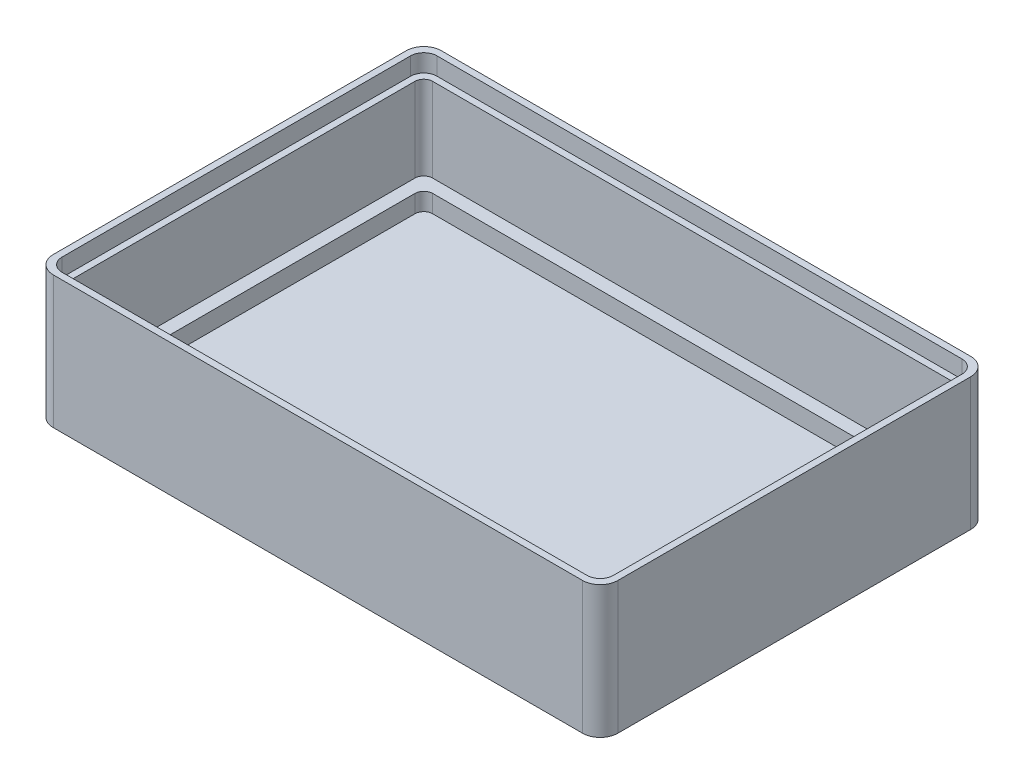
ISO-10303-21;
HEADER;
FILE_DESCRIPTION(('STEP AP214'),'2;1');
FILE_NAME('part.step','',(''),(''),'','','');
FILE_SCHEMA(('AUTOMOTIVE_DESIGN { 1 0 10303 214 1 1 1 1 }'));
ENDSEC;
DATA;
#1=APPLICATION_CONTEXT('core data for automotive mechanical design processes');
#2=APPLICATION_PROTOCOL_DEFINITION('international standard','automotive_design',2000,#1);
#3=PRODUCT_CONTEXT('',#1,'mechanical');
#4=PRODUCT('Part','Part','',(#3));
#5=PRODUCT_RELATED_PRODUCT_CATEGORY('part','',(#4));
#6=PRODUCT_DEFINITION_FORMATION('','',#4);
#7=PRODUCT_DEFINITION_CONTEXT('part definition',#1,'design');
#8=PRODUCT_DEFINITION('design','',#6,#7);
#9=PRODUCT_DEFINITION_SHAPE('','',#8);
#10=(LENGTH_UNIT() NAMED_UNIT(*) SI_UNIT(.MILLI.,.METRE.));
#11=(NAMED_UNIT(*) PLANE_ANGLE_UNIT() SI_UNIT($,.RADIAN.));
#12=(NAMED_UNIT(*) SI_UNIT($,.STERADIAN.) SOLID_ANGLE_UNIT());
#13=UNCERTAINTY_MEASURE_WITH_UNIT(LENGTH_MEASURE(1.E-05),#10,'distance_accuracy_value','');
#14=(GEOMETRIC_REPRESENTATION_CONTEXT(3) GLOBAL_UNCERTAINTY_ASSIGNED_CONTEXT((#13)) GLOBAL_UNIT_ASSIGNED_CONTEXT((#10,
#11,#12)) REPRESENTATION_CONTEXT('',''));
#15=CARTESIAN_POINT('',(0.,0.,0.));
#16=DIRECTION('',(0.,0.,1.));
#17=DIRECTION('',(1.,0.,0.));
#18=AXIS2_PLACEMENT_3D('',#15,#16,#17);
#19=CARTESIAN_POINT('',(62.5,1.5,-42.5));
#20=DIRECTION('',(1.,0.,0.));
#21=DIRECTION('',(0.,0.,-1.));
#22=AXIS2_PLACEMENT_3D('',#19,#20,#21);
#23=PLANE('',#22);
#24=DIRECTION('',(0.,1.,0.));
#25=VECTOR('',#24,1.);
#26=CARTESIAN_POINT('',(62.5,15.,-2.5));
#27=LINE('',#26,#25);
#28=CARTESIAN_POINT('',(62.5,3.5,-2.50000000000002));
#29=VERTEX_POINT('',#28);
#30=CARTESIAN_POINT('',(62.5,13.,-2.5));
#31=VERTEX_POINT('',#30);
#32=EDGE_CURVE('E265',#29,#31,#27,.T.);
#33=ORIENTED_EDGE('',*,*,#32,.T.);
#34=DIRECTION('',(0.,0.,-1.));
#35=VECTOR('',#34,1.);
#36=CARTESIAN_POINT('',(62.5,13.,-2.5));
#37=LINE('',#36,#35);
#38=CARTESIAN_POINT('',(62.5,13.,-41.5));
#39=VERTEX_POINT('',#38);
#40=EDGE_CURVE('E395',#31,#39,#37,.T.);
#41=ORIENTED_EDGE('',*,*,#40,.T.);
#42=DIRECTION('',(0.,1.,0.));
#43=VECTOR('',#42,1.);
#44=CARTESIAN_POINT('',(62.5,3.5,-41.5));
#45=LINE('',#44,#43);
#46=CARTESIAN_POINT('',(62.5,3.5,-41.5));
#47=VERTEX_POINT('',#46);
#48=EDGE_CURVE('E270',#39,#47,#45,.F.);
#49=ORIENTED_EDGE('',*,*,#48,.T.);
#50=DIRECTION('',(0.,0.,-1.));
#51=VECTOR('',#50,1.);
#52=CARTESIAN_POINT('',(62.5,3.5,-42.5));
#53=LINE('',#52,#51);
#54=EDGE_CURVE('E393',#29,#47,#53,.T.);
#55=ORIENTED_EDGE('',*,*,#54,.F.);
#56=EDGE_LOOP('',(#33,#41,#49,#55));
#57=FACE_BOUND('',#56,.T.);
#58=ADVANCED_FACE('F35',(#57),#23,.F.);
#59=CARTESIAN_POINT('',(62.5,1.5,-1.5));
#60=DIRECTION('',(0.,0.,1.));
#61=DIRECTION('',(1.,0.,0.));
#62=AXIS2_PLACEMENT_3D('',#59,#60,#61);
#63=PLANE('',#62);
#64=DIRECTION('',(0.,1.,0.));
#65=VECTOR('',#64,1.);
#66=CARTESIAN_POINT('',(2.5,15.,-1.49999999999999));
#67=LINE('',#66,#65);
#68=CARTESIAN_POINT('',(2.5,3.5,-1.49999999999999));
#69=VERTEX_POINT('',#68);
#70=CARTESIAN_POINT('',(2.5,13.,-1.49999999999999));
#71=VERTEX_POINT('',#70);
#72=EDGE_CURVE('E257',#69,#71,#67,.T.);
#73=ORIENTED_EDGE('',*,*,#72,.T.);
#74=DIRECTION('',(1.,0.,0.));
#75=VECTOR('',#74,1.);
#76=CARTESIAN_POINT('',(2.5,13.,-1.49999999999999));
#77=LINE('',#76,#75);
#78=CARTESIAN_POINT('',(61.5,13.,-1.5));
#79=VERTEX_POINT('',#78);
#80=EDGE_CURVE('E241',#71,#79,#77,.T.);
#81=ORIENTED_EDGE('',*,*,#80,.T.);
#82=DIRECTION('',(0.,1.,0.));
#83=VECTOR('',#82,1.);
#84=CARTESIAN_POINT('',(61.5,3.5,-1.5));
#85=LINE('',#84,#83);
#86=CARTESIAN_POINT('',(61.5,3.5,-1.49999999999999));
#87=VERTEX_POINT('',#86);
#88=EDGE_CURVE('E264',#79,#87,#85,.F.);
#89=ORIENTED_EDGE('',*,*,#88,.T.);
#90=DIRECTION('',(1.,0.,0.));
#91=VECTOR('',#90,1.);
#92=CARTESIAN_POINT('',(62.5,3.5,-1.49999999999999));
#93=LINE('',#92,#91);
#94=EDGE_CURVE('E263',#69,#87,#93,.T.);
#95=ORIENTED_EDGE('',*,*,#94,.F.);
#96=EDGE_LOOP('',(#73,#81,#89,#95));
#97=FACE_BOUND('',#96,.T.);
#98=ADVANCED_FACE('F261',(#97),#63,.F.);
#99=CARTESIAN_POINT('',(1.49999999999999,1.5,-42.5));
#100=DIRECTION('',(-1.,0.,0.));
#101=DIRECTION('',(0.,0.,1.));
#102=AXIS2_PLACEMENT_3D('',#99,#100,#101);
#103=PLANE('',#102);
#104=DIRECTION('',(0.,1.,0.));
#105=VECTOR('',#104,1.);
#106=CARTESIAN_POINT('',(1.49999999999999,15.,-41.5));
#107=LINE('',#106,#105);
#108=CARTESIAN_POINT('',(1.49999999999999,3.5,-41.5));
#109=VERTEX_POINT('',#108);
#110=CARTESIAN_POINT('',(1.49999999999999,13.,-41.5));
#111=VERTEX_POINT('',#110);
#112=EDGE_CURVE('E286',#109,#111,#107,.T.);
#113=ORIENTED_EDGE('',*,*,#112,.T.);
#114=DIRECTION('',(0.,0.,1.));
#115=VECTOR('',#114,1.);
#116=CARTESIAN_POINT('',(1.49999999999999,13.,-41.5));
#117=LINE('',#116,#115);
#118=CARTESIAN_POINT('',(1.49999999999999,13.,-2.50000000000001));
#119=VERTEX_POINT('',#118);
#120=EDGE_CURVE('E58',#111,#119,#117,.T.);
#121=ORIENTED_EDGE('',*,*,#120,.T.);
#122=DIRECTION('',(0.,1.,0.));
#123=VECTOR('',#122,1.);
#124=CARTESIAN_POINT('',(1.49999999999999,3.5,-2.49999999999999));
#125=LINE('',#124,#123);
#126=CARTESIAN_POINT('',(1.49999999999999,3.5,-2.50000000000001));
#127=VERTEX_POINT('',#126);
#128=EDGE_CURVE('E258',#119,#127,#125,.F.);
#129=ORIENTED_EDGE('',*,*,#128,.T.);
#130=DIRECTION('',(0.,0.,1.));
#131=VECTOR('',#130,1.);
#132=CARTESIAN_POINT('',(1.49999999999999,3.5,-42.5));
#133=LINE('',#132,#131);
#134=EDGE_CURVE('E351',#109,#127,#133,.T.);
#135=ORIENTED_EDGE('',*,*,#134,.F.);
#136=EDGE_LOOP('',(#113,#121,#129,#135));
#137=FACE_BOUND('',#136,.T.);
#138=ADVANCED_FACE('F459',(#137),#103,.F.);
#139=CARTESIAN_POINT('',(62.5,1.5,-42.5));
#140=DIRECTION('',(0.,0.,-1.));
#141=DIRECTION('',(-1.,0.,0.));
#142=AXIS2_PLACEMENT_3D('',#139,#140,#141);
#143=PLANE('',#142);
#144=DIRECTION('',(0.,1.,0.));
#145=VECTOR('',#144,1.);
#146=CARTESIAN_POINT('',(61.5,15.,-42.5));
#147=LINE('',#146,#145);
#148=CARTESIAN_POINT('',(61.5,3.5,-42.5));
#149=VERTEX_POINT('',#148);
#150=CARTESIAN_POINT('',(61.5,13.,-42.5));
#151=VERTEX_POINT('',#150);
#152=EDGE_CURVE('E283',#149,#151,#147,.T.);
#153=ORIENTED_EDGE('',*,*,#152,.T.);
#154=DIRECTION('',(-1.,0.,0.));
#155=VECTOR('',#154,1.);
#156=CARTESIAN_POINT('',(61.5,13.,-42.5));
#157=LINE('',#156,#155);
#158=CARTESIAN_POINT('',(2.5,13.,-42.5));
#159=VERTEX_POINT('',#158);
#160=EDGE_CURVE('E414',#151,#159,#157,.T.);
#161=ORIENTED_EDGE('',*,*,#160,.T.);
#162=DIRECTION('',(0.,1.,0.));
#163=VECTOR('',#162,1.);
#164=CARTESIAN_POINT('',(2.49999999999999,3.5,-42.5));
#165=LINE('',#164,#163);
#166=CARTESIAN_POINT('',(2.49999999999999,3.5,-42.5));
#167=VERTEX_POINT('',#166);
#168=EDGE_CURVE('E281',#159,#167,#165,.F.);
#169=ORIENTED_EDGE('',*,*,#168,.T.);
#170=DIRECTION('',(-1.,0.,0.));
#171=VECTOR('',#170,1.);
#172=CARTESIAN_POINT('',(62.5,3.5,-42.5));
#173=LINE('',#172,#171);
#174=EDGE_CURVE('E405',#149,#167,#173,.T.);
#175=ORIENTED_EDGE('',*,*,#174,.F.);
#176=EDGE_LOOP('',(#153,#161,#169,#175));
#177=FACE_BOUND('',#176,.T.);
#178=ADVANCED_FACE('F413',(#177),#143,.F.);
#179=CARTESIAN_POINT('',(0.,3.5,0.));
#180=DIRECTION('',(0.,-1.,0.));
#181=DIRECTION('',(0.,0.,-1.));
#182=AXIS2_PLACEMENT_3D('',#179,#180,#181);
#183=PLANE('',#182);
#184=ORIENTED_EDGE('',*,*,#94,.T.);
#185=CARTESIAN_POINT('',(61.5,3.5,-2.5));
#186=DIRECTION('',(0.,-1.,0.));
#187=DIRECTION('',(0.,0.,-1.));
#188=AXIS2_PLACEMENT_3D('',#185,#186,#187);
#189=CIRCLE('',#188,1.);
#190=EDGE_CURVE('E279',#87,#29,#189,.F.);
#191=ORIENTED_EDGE('',*,*,#190,.T.);
#192=ORIENTED_EDGE('',*,*,#54,.T.);
#193=CARTESIAN_POINT('',(61.5,3.5,-41.5));
#194=DIRECTION('',(0.,-1.,0.));
#195=DIRECTION('',(0.,0.,-1.));
#196=AXIS2_PLACEMENT_3D('',#193,#194,#195);
#197=CIRCLE('',#196,1.);
#198=EDGE_CURVE('E277',#47,#149,#197,.F.);
#199=ORIENTED_EDGE('',*,*,#198,.T.);
#200=ORIENTED_EDGE('',*,*,#174,.T.);
#201=CARTESIAN_POINT('',(2.49999999999999,3.5,-41.5));
#202=DIRECTION('',(0.,-1.,0.));
#203=DIRECTION('',(0.,0.,-1.));
#204=AXIS2_PLACEMENT_3D('',#201,#202,#203);
#205=CIRCLE('',#204,1.);
#206=EDGE_CURVE('E267',#167,#109,#205,.F.);
#207=ORIENTED_EDGE('',*,*,#206,.T.);
#208=ORIENTED_EDGE('',*,*,#134,.T.);
#209=CARTESIAN_POINT('',(2.5,3.5,-2.49999999999999));
#210=DIRECTION('',(0.,-1.,0.));
#211=DIRECTION('',(0.,0.,-1.));
#212=AXIS2_PLACEMENT_3D('',#209,#210,#211);
#213=CIRCLE('',#212,1.);
#214=EDGE_CURVE('E275',#127,#69,#213,.F.);
#215=ORIENTED_EDGE('',*,*,#214,.T.);
#216=EDGE_LOOP('',(#184,#191,#192,#199,#200,#207,#208,#215));
#217=FACE_BOUND('',#216,.T.);
#218=DIRECTION('',(0.,0.,-1.));
#219=VECTOR('',#218,1.);
#220=CARTESIAN_POINT('',(61.004099557469,3.5,-41.));
#221=LINE('',#220,#219);
#222=CARTESIAN_POINT('',(61.004099557469,3.5,-4.));
#223=VERTEX_POINT('',#222);
#224=CARTESIAN_POINT('',(61.004099557469,3.5,-40.));
#225=VERTEX_POINT('',#224);
#226=EDGE_CURVE('E584',#223,#225,#221,.T.);
#227=ORIENTED_EDGE('',*,*,#226,.F.);
#228=CARTESIAN_POINT('',(60.004099557469,3.5,-4.));
#229=DIRECTION('',(0.,-1.,0.));
#230=DIRECTION('',(0.,0.,-1.));
#231=AXIS2_PLACEMENT_3D('',#228,#229,#230);
#232=CIRCLE('',#231,1.);
#233=CARTESIAN_POINT('',(60.004099557469,3.5,-3.));
#234=VERTEX_POINT('',#233);
#235=EDGE_CURVE('E290',#223,#234,#232,.T.);
#236=ORIENTED_EDGE('',*,*,#235,.T.);
#237=DIRECTION('',(1.,0.,0.));
#238=VECTOR('',#237,1.);
#239=CARTESIAN_POINT('',(61.004099557469,3.5,-3.));
#240=LINE('',#239,#238);
#241=CARTESIAN_POINT('',(4.00409955746905,3.5,-3.));
#242=VERTEX_POINT('',#241);
#243=EDGE_CURVE('E406',#242,#234,#240,.T.);
#244=ORIENTED_EDGE('',*,*,#243,.F.);
#245=CARTESIAN_POINT('',(4.00409955746904,3.5,-4.));
#246=DIRECTION('',(0.,-1.,0.));
#247=DIRECTION('',(0.,0.,-1.));
#248=AXIS2_PLACEMENT_3D('',#245,#246,#247);
#249=CIRCLE('',#248,1.);
#250=CARTESIAN_POINT('',(3.00409955746904,3.5,-4.));
#251=VERTEX_POINT('',#250);
#252=EDGE_CURVE('E294',#242,#251,#249,.T.);
#253=ORIENTED_EDGE('',*,*,#252,.T.);
#254=DIRECTION('',(0.,0.,1.));
#255=VECTOR('',#254,1.);
#256=CARTESIAN_POINT('',(3.00409955746903,3.5,-41.));
#257=LINE('',#256,#255);
#258=CARTESIAN_POINT('',(3.00409955746903,3.5,-40.));
#259=VERTEX_POINT('',#258);
#260=EDGE_CURVE('E591',#259,#251,#257,.T.);
#261=ORIENTED_EDGE('',*,*,#260,.F.);
#262=CARTESIAN_POINT('',(4.00409955746903,3.5,-40.));
#263=DIRECTION('',(0.,-1.,0.));
#264=DIRECTION('',(0.,0.,-1.));
#265=AXIS2_PLACEMENT_3D('',#262,#263,#264);
#266=CIRCLE('',#265,1.);
#267=CARTESIAN_POINT('',(4.00409955746903,3.5,-41.));
#268=VERTEX_POINT('',#267);
#269=EDGE_CURVE('E296',#259,#268,#266,.T.);
#270=ORIENTED_EDGE('',*,*,#269,.T.);
#271=DIRECTION('',(-1.,0.,0.));
#272=VECTOR('',#271,1.);
#273=CARTESIAN_POINT('',(61.004099557469,3.5,-41.));
#274=LINE('',#273,#272);
#275=CARTESIAN_POINT('',(60.004099557469,3.5,-41.));
#276=VERTEX_POINT('',#275);
#277=EDGE_CURVE('E587',#276,#268,#274,.T.);
#278=ORIENTED_EDGE('',*,*,#277,.F.);
#279=CARTESIAN_POINT('',(60.004099557469,3.5,-40.));
#280=DIRECTION('',(0.,-1.,0.));
#281=DIRECTION('',(0.,0.,-1.));
#282=AXIS2_PLACEMENT_3D('',#279,#280,#281);
#283=CIRCLE('',#282,1.);
#284=EDGE_CURVE('E292',#276,#225,#283,.T.);
#285=ORIENTED_EDGE('',*,*,#284,.T.);
#286=EDGE_LOOP('',(#227,#236,#244,#253,#261,#270,#278,#285));
#287=FACE_BOUND('',#286,.T.);
#288=ADVANCED_FACE('F400',(#217,#287),#183,.F.);
#289=CARTESIAN_POINT('',(61.004099557469,3.5,-41.));
#290=DIRECTION('',(-1.,0.,0.));
#291=DIRECTION('',(0.,0.,1.));
#292=AXIS2_PLACEMENT_3D('',#289,#290,#291);
#293=PLANE('',#292);
#294=DIRECTION('',(0.,0.,-1.));
#295=VECTOR('',#294,1.);
#296=CARTESIAN_POINT('',(61.004099557469,1.5,-41.));
#297=LINE('',#296,#295);
#298=CARTESIAN_POINT('',(61.004099557469,1.5,-4.));
#299=VERTEX_POINT('',#298);
#300=CARTESIAN_POINT('',(61.004099557469,1.5,-40.));
#301=VERTEX_POINT('',#300);
#302=EDGE_CURVE('E570',#299,#301,#297,.T.);
#303=ORIENTED_EDGE('',*,*,#302,.F.);
#304=DIRECTION('',(0.,-1.,0.));
#305=VECTOR('',#304,1.);
#306=CARTESIAN_POINT('',(61.004099557469,3.5,-4.));
#307=LINE('',#306,#305);
#308=EDGE_CURVE('E377',#299,#223,#307,.F.);
#309=ORIENTED_EDGE('',*,*,#308,.T.);
#310=ORIENTED_EDGE('',*,*,#226,.T.);
#311=DIRECTION('',(0.,-1.,0.));
#312=VECTOR('',#311,1.);
#313=CARTESIAN_POINT('',(61.004099557469,1.5,-40.));
#314=LINE('',#313,#312);
#315=EDGE_CURVE('E374',#225,#301,#314,.T.);
#316=ORIENTED_EDGE('',*,*,#315,.T.);
#317=EDGE_LOOP('',(#303,#309,#310,#316));
#318=FACE_BOUND('',#317,.T.);
#319=ADVANCED_FACE('F631',(#318),#293,.T.);
#320=CARTESIAN_POINT('',(61.004099557469,3.5,-41.));
#321=DIRECTION('',(0.,0.,1.));
#322=DIRECTION('',(1.,0.,0.));
#323=AXIS2_PLACEMENT_3D('',#320,#321,#322);
#324=PLANE('',#323);
#325=DIRECTION('',(-1.,0.,0.));
#326=VECTOR('',#325,1.);
#327=CARTESIAN_POINT('',(61.004099557469,1.5,-41.));
#328=LINE('',#327,#326);
#329=CARTESIAN_POINT('',(60.004099557469,1.5,-41.));
#330=VERTEX_POINT('',#329);
#331=CARTESIAN_POINT('',(4.00409955746903,1.5,-41.));
#332=VERTEX_POINT('',#331);
#333=EDGE_CURVE('E598',#330,#332,#328,.T.);
#334=ORIENTED_EDGE('',*,*,#333,.F.);
#335=DIRECTION('',(0.,-1.,0.));
#336=VECTOR('',#335,1.);
#337=CARTESIAN_POINT('',(60.004099557469,3.5,-41.));
#338=LINE('',#337,#336);
#339=EDGE_CURVE('E382',#330,#276,#338,.F.);
#340=ORIENTED_EDGE('',*,*,#339,.T.);
#341=ORIENTED_EDGE('',*,*,#277,.T.);
#342=DIRECTION('',(0.,-1.,0.));
#343=VECTOR('',#342,1.);
#344=CARTESIAN_POINT('',(4.00409955746903,1.5,-41.));
#345=LINE('',#344,#343);
#346=EDGE_CURVE('E379',#268,#332,#345,.T.);
#347=ORIENTED_EDGE('',*,*,#346,.T.);
#348=EDGE_LOOP('',(#334,#340,#341,#347));
#349=FACE_BOUND('',#348,.T.);
#350=ADVANCED_FACE('F626',(#349),#324,.T.);
#351=CARTESIAN_POINT('',(3.00409955746903,3.5,-41.));
#352=DIRECTION('',(1.,0.,0.));
#353=DIRECTION('',(0.,0.,-1.));
#354=AXIS2_PLACEMENT_3D('',#351,#352,#353);
#355=PLANE('',#354);
#356=ORIENTED_EDGE('',*,*,#260,.T.);
#357=DIRECTION('',(0.,-1.,0.));
#358=VECTOR('',#357,1.);
#359=CARTESIAN_POINT('',(3.00409955746904,1.5,-4.));
#360=LINE('',#359,#358);
#361=CARTESIAN_POINT('',(3.00409955746904,1.5,-4.));
#362=VERTEX_POINT('',#361);
#363=EDGE_CURVE('E386',#251,#362,#360,.T.);
#364=ORIENTED_EDGE('',*,*,#363,.T.);
#365=DIRECTION('',(0.,0.,1.));
#366=VECTOR('',#365,1.);
#367=CARTESIAN_POINT('',(3.00409955746903,1.5,-41.));
#368=LINE('',#367,#366);
#369=CARTESIAN_POINT('',(3.00409955746903,1.5,-40.));
#370=VERTEX_POINT('',#369);
#371=EDGE_CURVE('E601',#370,#362,#368,.T.);
#372=ORIENTED_EDGE('',*,*,#371,.F.);
#373=DIRECTION('',(0.,-1.,0.));
#374=VECTOR('',#373,1.);
#375=CARTESIAN_POINT('',(3.00409955746903,3.5,-40.));
#376=LINE('',#375,#374);
#377=EDGE_CURVE('E384',#370,#259,#376,.F.);
#378=ORIENTED_EDGE('',*,*,#377,.T.);
#379=EDGE_LOOP('',(#356,#364,#372,#378));
#380=FACE_BOUND('',#379,.T.);
#381=ADVANCED_FACE('F618',(#380),#355,.T.);
#382=CARTESIAN_POINT('',(61.004099557469,3.5,-3.));
#383=DIRECTION('',(0.,0.,-1.));
#384=DIRECTION('',(-1.,0.,0.));
#385=AXIS2_PLACEMENT_3D('',#382,#383,#384);
#386=PLANE('',#385);
#387=ORIENTED_EDGE('',*,*,#243,.T.);
#388=DIRECTION('',(0.,-1.,0.));
#389=VECTOR('',#388,1.);
#390=CARTESIAN_POINT('',(60.004099557469,1.5,-3.));
#391=LINE('',#390,#389);
#392=CARTESIAN_POINT('',(60.004099557469,1.5,-3.));
#393=VERTEX_POINT('',#392);
#394=EDGE_CURVE('E363',#234,#393,#391,.T.);
#395=ORIENTED_EDGE('',*,*,#394,.T.);
#396=DIRECTION('',(1.,0.,0.));
#397=VECTOR('',#396,1.);
#398=CARTESIAN_POINT('',(61.004099557469,1.5,-3.));
#399=LINE('',#398,#397);
#400=CARTESIAN_POINT('',(4.00409955746905,1.5,-3.));
#401=VERTEX_POINT('',#400);
#402=EDGE_CURVE('E588',#401,#393,#399,.T.);
#403=ORIENTED_EDGE('',*,*,#402,.F.);
#404=DIRECTION('',(0.,-1.,0.));
#405=VECTOR('',#404,1.);
#406=CARTESIAN_POINT('',(4.00409955746904,3.5,-3.));
#407=LINE('',#406,#405);
#408=EDGE_CURVE('E361',#401,#242,#407,.F.);
#409=ORIENTED_EDGE('',*,*,#408,.T.);
#410=EDGE_LOOP('',(#387,#395,#403,#409));
#411=FACE_BOUND('',#410,.T.);
#412=ADVANCED_FACE('F609',(#411),#386,.T.);
#413=CARTESIAN_POINT('',(0.,1.5,0.));
#414=DIRECTION('',(0.,-1.,0.));
#415=DIRECTION('',(0.,0.,-1.));
#416=AXIS2_PLACEMENT_3D('',#413,#414,#415);
#417=PLANE('',#416);
#418=ORIENTED_EDGE('',*,*,#402,.T.);
#419=CARTESIAN_POINT('',(60.004099557469,1.5,-4.));
#420=DIRECTION('',(0.,-1.,0.));
#421=DIRECTION('',(0.,0.,-1.));
#422=AXIS2_PLACEMENT_3D('',#419,#420,#421);
#423=CIRCLE('',#422,1.);
#424=EDGE_CURVE('E372',#393,#299,#423,.F.);
#425=ORIENTED_EDGE('',*,*,#424,.T.);
#426=ORIENTED_EDGE('',*,*,#302,.T.);
#427=CARTESIAN_POINT('',(60.004099557469,1.5,-40.));
#428=DIRECTION('',(0.,-1.,0.));
#429=DIRECTION('',(0.,0.,-1.));
#430=AXIS2_PLACEMENT_3D('',#427,#428,#429);
#431=CIRCLE('',#430,1.);
#432=EDGE_CURVE('E370',#301,#330,#431,.F.);
#433=ORIENTED_EDGE('',*,*,#432,.T.);
#434=ORIENTED_EDGE('',*,*,#333,.T.);
#435=CARTESIAN_POINT('',(4.00409955746903,1.5,-40.));
#436=DIRECTION('',(0.,-1.,0.));
#437=DIRECTION('',(0.,0.,-1.));
#438=AXIS2_PLACEMENT_3D('',#435,#436,#437);
#439=CIRCLE('',#438,1.);
#440=EDGE_CURVE('E366',#332,#370,#439,.F.);
#441=ORIENTED_EDGE('',*,*,#440,.T.);
#442=ORIENTED_EDGE('',*,*,#371,.T.);
#443=CARTESIAN_POINT('',(4.00409955746904,1.5,-4.));
#444=DIRECTION('',(0.,-1.,0.));
#445=DIRECTION('',(0.,0.,-1.));
#446=AXIS2_PLACEMENT_3D('',#443,#444,#445);
#447=CIRCLE('',#446,1.);
#448=EDGE_CURVE('E368',#362,#401,#447,.F.);
#449=ORIENTED_EDGE('',*,*,#448,.T.);
#450=EDGE_LOOP('',(#418,#425,#426,#433,#434,#441,#442,#449));
#451=FACE_BOUND('',#450,.T.);
#452=ADVANCED_FACE('F481',(#451),#417,.F.);
#453=CARTESIAN_POINT('',(60.004099557469,3.5,-4.));
#454=DIRECTION('',(0.,1.,0.));
#455=DIRECTION('',(0.,0.,1.));
#456=AXIS2_PLACEMENT_3D('',#453,#454,#455);
#457=CYLINDRICAL_SURFACE('',#456,1.);
#458=ORIENTED_EDGE('',*,*,#235,.F.);
#459=ORIENTED_EDGE('',*,*,#308,.F.);
#460=ORIENTED_EDGE('',*,*,#424,.F.);
#461=ORIENTED_EDGE('',*,*,#394,.F.);
#462=EDGE_LOOP('',(#458,#459,#460,#461));
#463=FACE_BOUND('',#462,.T.);
#464=ADVANCED_FACE('F477',(#463),#457,.F.);
#465=CARTESIAN_POINT('',(60.004099557469,3.5,-40.));
#466=DIRECTION('',(0.,1.,0.));
#467=DIRECTION('',(0.,0.,1.));
#468=AXIS2_PLACEMENT_3D('',#465,#466,#467);
#469=CYLINDRICAL_SURFACE('',#468,1.);
#470=ORIENTED_EDGE('',*,*,#284,.F.);
#471=ORIENTED_EDGE('',*,*,#339,.F.);
#472=ORIENTED_EDGE('',*,*,#432,.F.);
#473=ORIENTED_EDGE('',*,*,#315,.F.);
#474=EDGE_LOOP('',(#470,#471,#472,#473));
#475=FACE_BOUND('',#474,.T.);
#476=ADVANCED_FACE('F480',(#475),#469,.F.);
#477=CARTESIAN_POINT('',(4.00409955746904,3.5,-4.));
#478=DIRECTION('',(0.,1.,0.));
#479=DIRECTION('',(0.,0.,1.));
#480=AXIS2_PLACEMENT_3D('',#477,#478,#479);
#481=CYLINDRICAL_SURFACE('',#480,1.);
#482=ORIENTED_EDGE('',*,*,#252,.F.);
#483=ORIENTED_EDGE('',*,*,#408,.F.);
#484=ORIENTED_EDGE('',*,*,#448,.F.);
#485=ORIENTED_EDGE('',*,*,#363,.F.);
#486=EDGE_LOOP('',(#482,#483,#484,#485));
#487=FACE_BOUND('',#486,.T.);
#488=ADVANCED_FACE('F485',(#487),#481,.F.);
#489=CARTESIAN_POINT('',(4.00409955746903,3.5,-40.));
#490=DIRECTION('',(0.,1.,0.));
#491=DIRECTION('',(0.,0.,1.));
#492=AXIS2_PLACEMENT_3D('',#489,#490,#491);
#493=CYLINDRICAL_SURFACE('',#492,1.);
#494=ORIENTED_EDGE('',*,*,#269,.F.);
#495=ORIENTED_EDGE('',*,*,#377,.F.);
#496=ORIENTED_EDGE('',*,*,#440,.F.);
#497=ORIENTED_EDGE('',*,*,#346,.F.);
#498=EDGE_LOOP('',(#494,#495,#496,#497));
#499=FACE_BOUND('',#498,.T.);
#500=ADVANCED_FACE('F489',(#499),#493,.F.);
#501=CARTESIAN_POINT('',(61.5,1.5,-2.5));
#502=DIRECTION('',(0.,-1.,0.));
#503=DIRECTION('',(0.,0.,-1.));
#504=AXIS2_PLACEMENT_3D('',#501,#502,#503);
#505=CYLINDRICAL_SURFACE('',#504,1.);
#506=ORIENTED_EDGE('',*,*,#88,.F.);
#507=CARTESIAN_POINT('',(61.5,13.,-2.5));
#508=DIRECTION('',(0.,1.,0.));
#509=DIRECTION('',(0.,0.,1.));
#510=AXIS2_PLACEMENT_3D('',#507,#508,#509);
#511=CIRCLE('',#510,1.);
#512=EDGE_CURVE('E247',#79,#31,#511,.T.);
#513=ORIENTED_EDGE('',*,*,#512,.T.);
#514=ORIENTED_EDGE('',*,*,#32,.F.);
#515=ORIENTED_EDGE('',*,*,#190,.F.);
#516=EDGE_LOOP('',(#506,#513,#514,#515));
#517=FACE_BOUND('',#516,.T.);
#518=ADVANCED_FACE('F493',(#517),#505,.F.);
#519=CARTESIAN_POINT('',(61.5,1.5,-41.5));
#520=DIRECTION('',(0.,-1.,0.));
#521=DIRECTION('',(0.,0.,-1.));
#522=AXIS2_PLACEMENT_3D('',#519,#520,#521);
#523=CYLINDRICAL_SURFACE('',#522,1.);
#524=ORIENTED_EDGE('',*,*,#48,.F.);
#525=CARTESIAN_POINT('',(61.5,13.,-41.5));
#526=DIRECTION('',(0.,1.,0.));
#527=DIRECTION('',(0.,0.,1.));
#528=AXIS2_PLACEMENT_3D('',#525,#526,#527);
#529=CIRCLE('',#528,0.999999999999997);
#530=EDGE_CURVE('E410',#39,#151,#529,.T.);
#531=ORIENTED_EDGE('',*,*,#530,.T.);
#532=ORIENTED_EDGE('',*,*,#152,.F.);
#533=ORIENTED_EDGE('',*,*,#198,.F.);
#534=EDGE_LOOP('',(#524,#531,#532,#533));
#535=FACE_BOUND('',#534,.T.);
#536=ADVANCED_FACE('F409',(#535),#523,.F.);
#537=CARTESIAN_POINT('',(2.5,1.5,-2.49999999999999));
#538=DIRECTION('',(0.,-1.,0.));
#539=DIRECTION('',(0.,0.,-1.));
#540=AXIS2_PLACEMENT_3D('',#537,#538,#539);
#541=CYLINDRICAL_SURFACE('',#540,1.);
#542=ORIENTED_EDGE('',*,*,#128,.F.);
#543=CARTESIAN_POINT('',(2.5,13.,-2.49999999999999));
#544=DIRECTION('',(0.,1.,0.));
#545=DIRECTION('',(0.,0.,1.));
#546=AXIS2_PLACEMENT_3D('',#543,#544,#545);
#547=CIRCLE('',#546,1.);
#548=EDGE_CURVE('E245',#119,#71,#547,.T.);
#549=ORIENTED_EDGE('',*,*,#548,.T.);
#550=ORIENTED_EDGE('',*,*,#72,.F.);
#551=ORIENTED_EDGE('',*,*,#214,.F.);
#552=EDGE_LOOP('',(#542,#549,#550,#551));
#553=FACE_BOUND('',#552,.T.);
#554=ADVANCED_FACE('F255',(#553),#541,.F.);
#555=CARTESIAN_POINT('',(2.49999999999999,1.5,-41.5));
#556=DIRECTION('',(0.,-1.,0.));
#557=DIRECTION('',(0.,0.,-1.));
#558=AXIS2_PLACEMENT_3D('',#555,#556,#557);
#559=CYLINDRICAL_SURFACE('',#558,1.);
#560=ORIENTED_EDGE('',*,*,#168,.F.);
#561=CARTESIAN_POINT('',(2.49999999999999,13.,-41.5));
#562=DIRECTION('',(0.,1.,0.));
#563=DIRECTION('',(0.,0.,1.));
#564=AXIS2_PLACEMENT_3D('',#561,#562,#563);
#565=CIRCLE('',#564,1.);
#566=EDGE_CURVE('E511',#159,#111,#565,.T.);
#567=ORIENTED_EDGE('',*,*,#566,.T.);
#568=ORIENTED_EDGE('',*,*,#112,.F.);
#569=ORIENTED_EDGE('',*,*,#206,.F.);
#570=EDGE_LOOP('',(#560,#567,#568,#569));
#571=FACE_BOUND('',#570,.T.);
#572=ADVANCED_FACE('F501',(#571),#559,.F.);
#573=CARTESIAN_POINT('',(2.24999999999999,13.,-2.25));
#574=DIRECTION('',(0.,1.,0.));
#575=DIRECTION('',(0.,0.,1.));
#576=AXIS2_PLACEMENT_3D('',#573,#574,#575);
#577=CYLINDRICAL_SURFACE('',#576,1.5);
#578=CARTESIAN_POINT('',(2.24999999999999,15.,-2.25));
#579=DIRECTION('',(0.,1.,0.));
#580=DIRECTION('',(0.,0.,-1.));
#581=AXIS2_PLACEMENT_3D('',#578,#579,#580);
#582=CIRCLE('',#581,1.5);
#583=CARTESIAN_POINT('',(0.749999999999992,15.,-2.25));
#584=VERTEX_POINT('',#583);
#585=CARTESIAN_POINT('',(2.24999999999999,15.,-0.75));
#586=VERTEX_POINT('',#585);
#587=EDGE_CURVE('E50',#584,#586,#582,.T.);
#588=ORIENTED_EDGE('',*,*,#587,.T.);
#589=DIRECTION('',(0.,1.,0.));
#590=VECTOR('',#589,1.);
#591=CARTESIAN_POINT('',(2.24999999999999,13.,-0.75));
#592=LINE('',#591,#590);
#593=CARTESIAN_POINT('',(2.24999999999999,13.,-0.75));
#594=VERTEX_POINT('',#593);
#595=EDGE_CURVE('E546',#594,#586,#592,.T.);
#596=ORIENTED_EDGE('',*,*,#595,.F.);
#597=CARTESIAN_POINT('',(2.24999999999999,13.,-2.25));
#598=DIRECTION('',(0.,1.,0.));
#599=DIRECTION('',(0.,0.,-1.));
#600=AXIS2_PLACEMENT_3D('',#597,#598,#599);
#601=CIRCLE('',#600,1.5);
#602=CARTESIAN_POINT('',(0.749999999999992,13.,-2.25));
#603=VERTEX_POINT('',#602);
#604=EDGE_CURVE('E521',#603,#594,#601,.T.);
#605=ORIENTED_EDGE('',*,*,#604,.F.);
#606=DIRECTION('',(0.,1.,0.));
#607=VECTOR('',#606,1.);
#608=CARTESIAN_POINT('',(0.749999999999992,13.,-2.25));
#609=LINE('',#608,#607);
#610=EDGE_CURVE('E568',#603,#584,#609,.T.);
#611=ORIENTED_EDGE('',*,*,#610,.T.);
#612=EDGE_LOOP('',(#588,#596,#605,#611));
#613=FACE_BOUND('',#612,.T.);
#614=ADVANCED_FACE('F503',(#613),#577,.F.);
#615=CARTESIAN_POINT('',(0.749999999999988,13.,-41.75));
#616=DIRECTION('',(-1.,0.,0.));
#617=DIRECTION('',(0.,0.,1.));
#618=AXIS2_PLACEMENT_3D('',#615,#616,#617);
#619=PLANE('',#618);
#620=DIRECTION('',(0.,0.,1.));
#621=VECTOR('',#620,1.);
#622=CARTESIAN_POINT('',(0.749999999999988,15.,-41.75));
#623=LINE('',#622,#621);
#624=CARTESIAN_POINT('',(0.749999999999987,15.,-41.75));
#625=VERTEX_POINT('',#624);
#626=EDGE_CURVE('E525',#625,#584,#623,.T.);
#627=ORIENTED_EDGE('',*,*,#626,.T.);
#628=ORIENTED_EDGE('',*,*,#610,.F.);
#629=DIRECTION('',(0.,0.,1.));
#630=VECTOR('',#629,1.);
#631=CARTESIAN_POINT('',(0.749999999999988,13.,-41.75));
#632=LINE('',#631,#630);
#633=CARTESIAN_POINT('',(0.749999999999987,13.,-41.75));
#634=VERTEX_POINT('',#633);
#635=EDGE_CURVE('E543',#634,#603,#632,.T.);
#636=ORIENTED_EDGE('',*,*,#635,.F.);
#637=DIRECTION('',(0.,1.,0.));
#638=VECTOR('',#637,1.);
#639=CARTESIAN_POINT('',(0.749999999999987,13.,-41.75));
#640=LINE('',#639,#638);
#641=EDGE_CURVE('E571',#634,#625,#640,.T.);
#642=ORIENTED_EDGE('',*,*,#641,.T.);
#643=EDGE_LOOP('',(#627,#628,#636,#642));
#644=FACE_BOUND('',#643,.T.);
#645=ADVANCED_FACE('F508',(#644),#619,.F.);
#646=CARTESIAN_POINT('',(2.24999999999999,13.,-41.75));
#647=DIRECTION('',(0.,1.,0.));
#648=DIRECTION('',(0.,0.,1.));
#649=AXIS2_PLACEMENT_3D('',#646,#647,#648);
#650=CYLINDRICAL_SURFACE('',#649,1.5);
#651=CARTESIAN_POINT('',(2.24999999999999,15.,-41.75));
#652=DIRECTION('',(0.,1.,0.));
#653=DIRECTION('',(0.,0.,1.));
#654=AXIS2_PLACEMENT_3D('',#651,#652,#653);
#655=CIRCLE('',#654,1.5);
#656=CARTESIAN_POINT('',(2.25,15.,-43.25));
#657=VERTEX_POINT('',#656);
#658=EDGE_CURVE('E563',#657,#625,#655,.T.);
#659=ORIENTED_EDGE('',*,*,#658,.T.);
#660=ORIENTED_EDGE('',*,*,#641,.F.);
#661=CARTESIAN_POINT('',(2.24999999999999,13.,-41.75));
#662=DIRECTION('',(0.,1.,0.));
#663=DIRECTION('',(0.,0.,1.));
#664=AXIS2_PLACEMENT_3D('',#661,#662,#663);
#665=CIRCLE('',#664,1.5);
#666=CARTESIAN_POINT('',(2.25,13.,-43.25));
#667=VERTEX_POINT('',#666);
#668=EDGE_CURVE('E540',#667,#634,#665,.T.);
#669=ORIENTED_EDGE('',*,*,#668,.F.);
#670=DIRECTION('',(0.,1.,0.));
#671=VECTOR('',#670,1.);
#672=CARTESIAN_POINT('',(2.25,13.,-43.25));
#673=LINE('',#672,#671);
#674=EDGE_CURVE('E573',#667,#657,#673,.T.);
#675=ORIENTED_EDGE('',*,*,#674,.T.);
#676=EDGE_LOOP('',(#659,#660,#669,#675));
#677=FACE_BOUND('',#676,.T.);
#678=ADVANCED_FACE('F802',(#677),#650,.F.);
#679=CARTESIAN_POINT('',(2.25,13.,-43.25));
#680=DIRECTION('',(0.,0.,-1.));
#681=DIRECTION('',(-1.,0.,0.));
#682=AXIS2_PLACEMENT_3D('',#679,#680,#681);
#683=PLANE('',#682);
#684=DIRECTION('',(-1.,0.,0.));
#685=VECTOR('',#684,1.);
#686=CARTESIAN_POINT('',(2.25,15.,-43.25));
#687=LINE('',#686,#685);
#688=CARTESIAN_POINT('',(61.75,15.,-43.25));
#689=VERTEX_POINT('',#688);
#690=EDGE_CURVE('E560',#689,#657,#687,.T.);
#691=ORIENTED_EDGE('',*,*,#690,.T.);
#692=ORIENTED_EDGE('',*,*,#674,.F.);
#693=DIRECTION('',(-1.,0.,0.));
#694=VECTOR('',#693,1.);
#695=CARTESIAN_POINT('',(2.25,13.,-43.25));
#696=LINE('',#695,#694);
#697=CARTESIAN_POINT('',(61.75,13.,-43.25));
#698=VERTEX_POINT('',#697);
#699=EDGE_CURVE('E537',#698,#667,#696,.T.);
#700=ORIENTED_EDGE('',*,*,#699,.F.);
#701=DIRECTION('',(0.,1.,0.));
#702=VECTOR('',#701,1.);
#703=CARTESIAN_POINT('',(61.75,13.,-43.25));
#704=LINE('',#703,#702);
#705=EDGE_CURVE('E575',#698,#689,#704,.T.);
#706=ORIENTED_EDGE('',*,*,#705,.T.);
#707=EDGE_LOOP('',(#691,#692,#700,#706));
#708=FACE_BOUND('',#707,.T.);
#709=ADVANCED_FACE('F811',(#708),#683,.F.);
#710=CARTESIAN_POINT('',(61.75,13.,-41.75));
#711=DIRECTION('',(0.,1.,0.));
#712=DIRECTION('',(0.,0.,1.));
#713=AXIS2_PLACEMENT_3D('',#710,#711,#712);
#714=CYLINDRICAL_SURFACE('',#713,1.5);
#715=CARTESIAN_POINT('',(61.75,15.,-41.75));
#716=DIRECTION('',(0.,1.,0.));
#717=DIRECTION('',(0.,0.,1.));
#718=AXIS2_PLACEMENT_3D('',#715,#716,#717);
#719=CIRCLE('',#718,1.5);
#720=CARTESIAN_POINT('',(63.25,15.,-41.75));
#721=VERTEX_POINT('',#720);
#722=EDGE_CURVE('E557',#721,#689,#719,.T.);
#723=ORIENTED_EDGE('',*,*,#722,.T.);
#724=ORIENTED_EDGE('',*,*,#705,.F.);
#725=CARTESIAN_POINT('',(61.75,13.,-41.75));
#726=DIRECTION('',(0.,1.,0.));
#727=DIRECTION('',(0.,0.,1.));
#728=AXIS2_PLACEMENT_3D('',#725,#726,#727);
#729=CIRCLE('',#728,1.5);
#730=CARTESIAN_POINT('',(63.25,13.,-41.75));
#731=VERTEX_POINT('',#730);
#732=EDGE_CURVE('E534',#731,#698,#729,.T.);
#733=ORIENTED_EDGE('',*,*,#732,.F.);
#734=DIRECTION('',(0.,1.,0.));
#735=VECTOR('',#734,1.);
#736=CARTESIAN_POINT('',(63.25,13.,-41.75));
#737=LINE('',#736,#735);
#738=EDGE_CURVE('E577',#731,#721,#737,.T.);
#739=ORIENTED_EDGE('',*,*,#738,.T.);
#740=EDGE_LOOP('',(#723,#724,#733,#739));
#741=FACE_BOUND('',#740,.T.);
#742=ADVANCED_FACE('F820',(#741),#714,.F.);
#743=CARTESIAN_POINT('',(63.25,13.,-41.75));
#744=DIRECTION('',(1.,0.,0.));
#745=DIRECTION('',(0.,0.,-1.));
#746=AXIS2_PLACEMENT_3D('',#743,#744,#745);
#747=PLANE('',#746);
#748=DIRECTION('',(0.,0.,-1.));
#749=VECTOR('',#748,1.);
#750=CARTESIAN_POINT('',(63.25,15.,-41.75));
#751=LINE('',#750,#749);
#752=CARTESIAN_POINT('',(63.25,15.,-2.25000000000001));
#753=VERTEX_POINT('',#752);
#754=EDGE_CURVE('E554',#753,#721,#751,.T.);
#755=ORIENTED_EDGE('',*,*,#754,.T.);
#756=ORIENTED_EDGE('',*,*,#738,.F.);
#757=DIRECTION('',(0.,0.,-1.));
#758=VECTOR('',#757,1.);
#759=CARTESIAN_POINT('',(63.25,13.,-41.75));
#760=LINE('',#759,#758);
#761=CARTESIAN_POINT('',(63.25,13.,-2.25000000000001));
#762=VERTEX_POINT('',#761);
#763=EDGE_CURVE('E531',#762,#731,#760,.T.);
#764=ORIENTED_EDGE('',*,*,#763,.F.);
#765=DIRECTION('',(0.,1.,0.));
#766=VECTOR('',#765,1.);
#767=CARTESIAN_POINT('',(63.25,13.,-2.25000000000001));
#768=LINE('',#767,#766);
#769=EDGE_CURVE('E579',#762,#753,#768,.T.);
#770=ORIENTED_EDGE('',*,*,#769,.T.);
#771=EDGE_LOOP('',(#755,#756,#764,#770));
#772=FACE_BOUND('',#771,.T.);
#773=ADVANCED_FACE('F829',(#772),#747,.F.);
#774=CARTESIAN_POINT('',(61.75,13.,-2.25));
#775=DIRECTION('',(0.,1.,0.));
#776=DIRECTION('',(0.,0.,1.));
#777=AXIS2_PLACEMENT_3D('',#774,#775,#776);
#778=CYLINDRICAL_SURFACE('',#777,1.5);
#779=CARTESIAN_POINT('',(61.75,15.,-2.25));
#780=DIRECTION('',(0.,1.,0.));
#781=DIRECTION('',(0.,0.,1.));
#782=AXIS2_PLACEMENT_3D('',#779,#780,#781);
#783=CIRCLE('',#782,1.5);
#784=CARTESIAN_POINT('',(61.75,15.,-0.75));
#785=VERTEX_POINT('',#784);
#786=EDGE_CURVE('E551',#785,#753,#783,.T.);
#787=ORIENTED_EDGE('',*,*,#786,.T.);
#788=ORIENTED_EDGE('',*,*,#769,.F.);
#789=CARTESIAN_POINT('',(61.75,13.,-2.25));
#790=DIRECTION('',(0.,1.,0.));
#791=DIRECTION('',(0.,0.,1.));
#792=AXIS2_PLACEMENT_3D('',#789,#790,#791);
#793=CIRCLE('',#792,1.5);
#794=CARTESIAN_POINT('',(61.75,13.,-0.75));
#795=VERTEX_POINT('',#794);
#796=EDGE_CURVE('E528',#795,#762,#793,.T.);
#797=ORIENTED_EDGE('',*,*,#796,.F.);
#798=DIRECTION('',(0.,1.,0.));
#799=VECTOR('',#798,1.);
#800=CARTESIAN_POINT('',(61.75,13.,-0.75));
#801=LINE('',#800,#799);
#802=EDGE_CURVE('E581',#795,#785,#801,.T.);
#803=ORIENTED_EDGE('',*,*,#802,.T.);
#804=EDGE_LOOP('',(#787,#788,#797,#803));
#805=FACE_BOUND('',#804,.T.);
#806=ADVANCED_FACE('F838',(#805),#778,.F.);
#807=CARTESIAN_POINT('',(2.24999999999999,13.,-0.75));
#808=DIRECTION('',(0.,0.,1.));
#809=DIRECTION('',(1.,0.,0.));
#810=AXIS2_PLACEMENT_3D('',#807,#808,#809);
#811=PLANE('',#810);
#812=DIRECTION('',(1.,0.,0.));
#813=VECTOR('',#812,1.);
#814=CARTESIAN_POINT('',(2.24999999999999,15.,-0.75));
#815=LINE('',#814,#813);
#816=EDGE_CURVE('E548',#586,#785,#815,.T.);
#817=ORIENTED_EDGE('',*,*,#816,.T.);
#818=ORIENTED_EDGE('',*,*,#802,.F.);
#819=DIRECTION('',(1.,0.,0.));
#820=VECTOR('',#819,1.);
#821=CARTESIAN_POINT('',(2.24999999999999,13.,-0.75));
#822=LINE('',#821,#820);
#823=EDGE_CURVE('E524',#594,#795,#822,.T.);
#824=ORIENTED_EDGE('',*,*,#823,.F.);
#825=ORIENTED_EDGE('',*,*,#595,.T.);
#826=EDGE_LOOP('',(#817,#818,#824,#825));
#827=FACE_BOUND('',#826,.T.);
#828=ADVANCED_FACE('F847',(#827),#811,.F.);
#829=CARTESIAN_POINT('',(2.24999999999999,13.,-2.25));
#830=DIRECTION('',(0.,-1.,0.));
#831=DIRECTION('',(0.,0.,-1.));
#832=AXIS2_PLACEMENT_3D('',#829,#830,#831);
#833=PLANE('',#832);
#834=ORIENTED_EDGE('',*,*,#566,.F.);
#835=ORIENTED_EDGE('',*,*,#160,.F.);
#836=ORIENTED_EDGE('',*,*,#530,.F.);
#837=ORIENTED_EDGE('',*,*,#40,.F.);
#838=ORIENTED_EDGE('',*,*,#512,.F.);
#839=ORIENTED_EDGE('',*,*,#80,.F.);
#840=ORIENTED_EDGE('',*,*,#548,.F.);
#841=ORIENTED_EDGE('',*,*,#120,.F.);
#842=EDGE_LOOP('',(#834,#835,#836,#837,#838,#839,#840,#841));
#843=FACE_BOUND('',#842,.T.);
#844=ORIENTED_EDGE('',*,*,#604,.T.);
#845=ORIENTED_EDGE('',*,*,#823,.T.);
#846=ORIENTED_EDGE('',*,*,#796,.T.);
#847=ORIENTED_EDGE('',*,*,#763,.T.);
#848=ORIENTED_EDGE('',*,*,#732,.T.);
#849=ORIENTED_EDGE('',*,*,#699,.T.);
#850=ORIENTED_EDGE('',*,*,#668,.T.);
#851=ORIENTED_EDGE('',*,*,#635,.T.);
#852=EDGE_LOOP('',(#844,#845,#846,#847,#848,#849,#850,#851));
#853=FACE_BOUND('',#852,.T.);
#854=ADVANCED_FACE('F243',(#843,#853),#833,.F.);
#855=CARTESIAN_POINT('',(0.,0.,0.));
#856=DIRECTION('',(0.,1.,0.));
#857=DIRECTION('',(0.,0.,1.));
#858=AXIS2_PLACEMENT_3D('',#855,#856,#857);
#859=PLANE('',#858);
#860=DIRECTION('',(-1.,0.,0.));
#861=VECTOR('',#860,1.);
#862=CARTESIAN_POINT('',(0.,0.,-44.));
#863=LINE('',#862,#861);
#864=CARTESIAN_POINT('',(62.,0.,-44.));
#865=VERTEX_POINT('',#864);
#866=CARTESIAN_POINT('',(1.99999999999999,0.,-44.));
#867=VERTEX_POINT('',#866);
#868=EDGE_CURVE('E359',#865,#867,#863,.T.);
#869=ORIENTED_EDGE('',*,*,#868,.F.);
#870=CARTESIAN_POINT('',(62.,0.,-42.));
#871=DIRECTION('',(0.,1.,0.));
#872=DIRECTION('',(0.,0.,1.));
#873=AXIS2_PLACEMENT_3D('',#870,#871,#872);
#874=CIRCLE('',#873,2.);
#875=CARTESIAN_POINT('',(64.,0.,-42.));
#876=VERTEX_POINT('',#875);
#877=EDGE_CURVE('E309',#865,#876,#874,.F.);
#878=ORIENTED_EDGE('',*,*,#877,.T.);
#879=DIRECTION('',(0.,0.,-1.));
#880=VECTOR('',#879,1.);
#881=CARTESIAN_POINT('',(64.,0.,-44.));
#882=LINE('',#881,#880);
#883=CARTESIAN_POINT('',(64.,0.,-2.));
#884=VERTEX_POINT('',#883);
#885=EDGE_CURVE('E349',#884,#876,#882,.T.);
#886=ORIENTED_EDGE('',*,*,#885,.F.);
#887=CARTESIAN_POINT('',(62.,0.,-2.));
#888=DIRECTION('',(0.,1.,0.));
#889=DIRECTION('',(0.,0.,1.));
#890=AXIS2_PLACEMENT_3D('',#887,#888,#889);
#891=CIRCLE('',#890,2.);
#892=CARTESIAN_POINT('',(62.,0.,0.));
#893=VERTEX_POINT('',#892);
#894=EDGE_CURVE('E307',#884,#893,#891,.F.);
#895=ORIENTED_EDGE('',*,*,#894,.T.);
#896=DIRECTION('',(1.,0.,0.));
#897=VECTOR('',#896,1.);
#898=CARTESIAN_POINT('',(0.,0.,0.));
#899=LINE('',#898,#897);
#900=CARTESIAN_POINT('',(2.,0.,0.));
#901=VERTEX_POINT('',#900);
#902=EDGE_CURVE('E346',#901,#893,#899,.T.);
#903=ORIENTED_EDGE('',*,*,#902,.F.);
#904=CARTESIAN_POINT('',(2.,0.,-2.));
#905=DIRECTION('',(0.,1.,0.));
#906=DIRECTION('',(0.,0.,1.));
#907=AXIS2_PLACEMENT_3D('',#904,#905,#906);
#908=CIRCLE('',#907,2.);
#909=CARTESIAN_POINT('',(0.,0.,-2.));
#910=VERTEX_POINT('',#909);
#911=EDGE_CURVE('E305',#901,#910,#908,.F.);
#912=ORIENTED_EDGE('',*,*,#911,.T.);
#913=DIRECTION('',(0.,0.,1.));
#914=VECTOR('',#913,1.);
#915=CARTESIAN_POINT('',(0.,0.,-44.));
#916=LINE('',#915,#914);
#917=CARTESIAN_POINT('',(0.,0.,-42.));
#918=VERTEX_POINT('',#917);
#919=EDGE_CURVE('E335',#918,#910,#916,.T.);
#920=ORIENTED_EDGE('',*,*,#919,.F.);
#921=CARTESIAN_POINT('',(1.99999999999999,0.,-42.));
#922=DIRECTION('',(0.,1.,0.));
#923=DIRECTION('',(0.,0.,1.));
#924=AXIS2_PLACEMENT_3D('',#921,#922,#923);
#925=CIRCLE('',#924,2.);
#926=EDGE_CURVE('E303',#918,#867,#925,.F.);
#927=ORIENTED_EDGE('',*,*,#926,.T.);
#928=EDGE_LOOP('',(#869,#878,#886,#895,#903,#912,#920,#927));
#929=FACE_BOUND('',#928,.T.);
#930=ADVANCED_FACE('F343',(#929),#859,.F.);
#931=CARTESIAN_POINT('',(62.,15.,-2.));
#932=DIRECTION('',(0.,-1.,0.));
#933=DIRECTION('',(0.,0.,-1.));
#934=AXIS2_PLACEMENT_3D('',#931,#932,#933);
#935=CYLINDRICAL_SURFACE('',#934,2.);
#936=CARTESIAN_POINT('',(62.,15.,-2.));
#937=DIRECTION('',(0.,1.,0.));
#938=DIRECTION('',(0.,0.,1.));
#939=AXIS2_PLACEMENT_3D('',#936,#937,#938);
#940=CIRCLE('',#939,2.);
#941=CARTESIAN_POINT('',(62.,15.,0.));
#942=VERTEX_POINT('',#941);
#943=CARTESIAN_POINT('',(64.,15.,-2.));
#944=VERTEX_POINT('',#943);
#945=EDGE_CURVE('E320',#942,#944,#940,.T.);
#946=ORIENTED_EDGE('',*,*,#945,.F.);
#947=DIRECTION('',(0.,-1.,0.));
#948=VECTOR('',#947,1.);
#949=CARTESIAN_POINT('',(62.,15.,0.));
#950=LINE('',#949,#948);
#951=EDGE_CURVE('E327',#893,#942,#950,.F.);
#952=ORIENTED_EDGE('',*,*,#951,.F.);
#953=ORIENTED_EDGE('',*,*,#894,.F.);
#954=DIRECTION('',(0.,-1.,0.));
#955=VECTOR('',#954,1.);
#956=CARTESIAN_POINT('',(64.,15.,-2.));
#957=LINE('',#956,#955);
#958=EDGE_CURVE('E311',#944,#884,#957,.T.);
#959=ORIENTED_EDGE('',*,*,#958,.F.);
#960=EDGE_LOOP('',(#946,#952,#953,#959));
#961=FACE_BOUND('',#960,.T.);
#962=ADVANCED_FACE('F468',(#961),#935,.T.);
#963=CARTESIAN_POINT('',(0.,15.,0.));
#964=DIRECTION('',(0.,0.,-1.));
#965=DIRECTION('',(-1.,0.,0.));
#966=AXIS2_PLACEMENT_3D('',#963,#964,#965);
#967=PLANE('',#966);
#968=ORIENTED_EDGE('',*,*,#902,.T.);
#969=ORIENTED_EDGE('',*,*,#951,.T.);
#970=DIRECTION('',(1.,0.,0.));
#971=VECTOR('',#970,1.);
#972=CARTESIAN_POINT('',(0.,15.,0.));
#973=LINE('',#972,#971);
#974=CARTESIAN_POINT('',(2.,15.,0.));
#975=VERTEX_POINT('',#974);
#976=EDGE_CURVE('E423',#975,#942,#973,.T.);
#977=ORIENTED_EDGE('',*,*,#976,.F.);
#978=DIRECTION('',(0.,-1.,0.));
#979=VECTOR('',#978,1.);
#980=CARTESIAN_POINT('',(2.,15.,0.));
#981=LINE('',#980,#979);
#982=EDGE_CURVE('E324',#975,#901,#981,.T.);
#983=ORIENTED_EDGE('',*,*,#982,.T.);
#984=EDGE_LOOP('',(#968,#969,#977,#983));
#985=FACE_BOUND('',#984,.T.);
#986=ADVANCED_FACE('F470',(#985),#967,.F.);
#987=CARTESIAN_POINT('',(2.,15.,-2.));
#988=DIRECTION('',(0.,-1.,0.));
#989=DIRECTION('',(0.,0.,-1.));
#990=AXIS2_PLACEMENT_3D('',#987,#988,#989);
#991=CYLINDRICAL_SURFACE('',#990,2.);
#992=CARTESIAN_POINT('',(2.,15.,-2.));
#993=DIRECTION('',(0.,1.,0.));
#994=DIRECTION('',(0.,0.,1.));
#995=AXIS2_PLACEMENT_3D('',#992,#993,#994);
#996=CIRCLE('',#995,2.);
#997=CARTESIAN_POINT('',(0.,15.,-2.));
#998=VERTEX_POINT('',#997);
#999=EDGE_CURVE('E318',#998,#975,#996,.T.);
#1000=ORIENTED_EDGE('',*,*,#999,.F.);
#1001=DIRECTION('',(0.,-1.,0.));
#1002=VECTOR('',#1001,1.);
#1003=CARTESIAN_POINT('',(0.,15.,-2.));
#1004=LINE('',#1003,#1002);
#1005=EDGE_CURVE('E11',#910,#998,#1004,.F.);
#1006=ORIENTED_EDGE('',*,*,#1005,.F.);
#1007=ORIENTED_EDGE('',*,*,#911,.F.);
#1008=ORIENTED_EDGE('',*,*,#982,.F.);
#1009=EDGE_LOOP('',(#1000,#1006,#1007,#1008));
#1010=FACE_BOUND('',#1009,.T.);
#1011=ADVANCED_FACE('F473',(#1010),#991,.T.);
#1012=CARTESIAN_POINT('',(0.,15.,-44.));
#1013=DIRECTION('',(1.,0.,0.));
#1014=DIRECTION('',(0.,0.,-1.));
#1015=AXIS2_PLACEMENT_3D('',#1012,#1013,#1014);
#1016=PLANE('',#1015);
#1017=ORIENTED_EDGE('',*,*,#919,.T.);
#1018=ORIENTED_EDGE('',*,*,#1005,.T.);
#1019=DIRECTION('',(0.,0.,1.));
#1020=VECTOR('',#1019,1.);
#1021=CARTESIAN_POINT('',(0.,15.,-44.));
#1022=LINE('',#1021,#1020);
#1023=CARTESIAN_POINT('',(0.,15.,-42.));
#1024=VERTEX_POINT('',#1023);
#1025=EDGE_CURVE('E338',#1024,#998,#1022,.T.);
#1026=ORIENTED_EDGE('',*,*,#1025,.F.);
#1027=DIRECTION('',(0.,-1.,0.));
#1028=VECTOR('',#1027,1.);
#1029=CARTESIAN_POINT('',(0.,15.,-42.));
#1030=LINE('',#1029,#1028);
#1031=EDGE_CURVE('E43',#1024,#918,#1030,.T.);
#1032=ORIENTED_EDGE('',*,*,#1031,.T.);
#1033=EDGE_LOOP('',(#1017,#1018,#1026,#1032));
#1034=FACE_BOUND('',#1033,.T.);
#1035=ADVANCED_FACE('F334',(#1034),#1016,.F.);
#1036=CARTESIAN_POINT('',(1.99999999999999,15.,-42.));
#1037=DIRECTION('',(0.,-1.,0.));
#1038=DIRECTION('',(0.,0.,-1.));
#1039=AXIS2_PLACEMENT_3D('',#1036,#1037,#1038);
#1040=CYLINDRICAL_SURFACE('',#1039,2.);
#1041=CARTESIAN_POINT('',(1.99999999999999,15.,-42.));
#1042=DIRECTION('',(0.,1.,0.));
#1043=DIRECTION('',(0.,0.,1.));
#1044=AXIS2_PLACEMENT_3D('',#1041,#1042,#1043);
#1045=CIRCLE('',#1044,2.);
#1046=CARTESIAN_POINT('',(1.99999999999999,15.,-44.));
#1047=VERTEX_POINT('',#1046);
#1048=EDGE_CURVE('E316',#1047,#1024,#1045,.T.);
#1049=ORIENTED_EDGE('',*,*,#1048,.F.);
#1050=DIRECTION('',(0.,-1.,0.));
#1051=VECTOR('',#1050,1.);
#1052=CARTESIAN_POINT('',(1.99999999999999,15.,-44.));
#1053=LINE('',#1052,#1051);
#1054=EDGE_CURVE('E298',#867,#1047,#1053,.F.);
#1055=ORIENTED_EDGE('',*,*,#1054,.F.);
#1056=ORIENTED_EDGE('',*,*,#926,.F.);
#1057=ORIENTED_EDGE('',*,*,#1031,.F.);
#1058=EDGE_LOOP('',(#1049,#1055,#1056,#1057));
#1059=FACE_BOUND('',#1058,.T.);
#1060=ADVANCED_FACE('F37',(#1059),#1040,.T.);
#1061=CARTESIAN_POINT('',(0.,15.,-44.));
#1062=DIRECTION('',(0.,0.,1.));
#1063=DIRECTION('',(1.,0.,0.));
#1064=AXIS2_PLACEMENT_3D('',#1061,#1062,#1063);
#1065=PLANE('',#1064);
#1066=DIRECTION('',(-1.,0.,0.));
#1067=VECTOR('',#1066,1.);
#1068=CARTESIAN_POINT('',(0.,15.,-44.));
#1069=LINE('',#1068,#1067);
#1070=CARTESIAN_POINT('',(62.,15.,-44.));
#1071=VERTEX_POINT('',#1070);
#1072=EDGE_CURVE('E354',#1071,#1047,#1069,.T.);
#1073=ORIENTED_EDGE('',*,*,#1072,.F.);
#1074=DIRECTION('',(0.,-1.,0.));
#1075=VECTOR('',#1074,1.);
#1076=CARTESIAN_POINT('',(62.,15.,-44.));
#1077=LINE('',#1076,#1075);
#1078=EDGE_CURVE('E300',#1071,#865,#1077,.T.);
#1079=ORIENTED_EDGE('',*,*,#1078,.T.);
#1080=ORIENTED_EDGE('',*,*,#868,.T.);
#1081=ORIENTED_EDGE('',*,*,#1054,.T.);
#1082=EDGE_LOOP('',(#1073,#1079,#1080,#1081));
#1083=FACE_BOUND('',#1082,.T.);
#1084=ADVANCED_FACE('F436',(#1083),#1065,.F.);
#1085=CARTESIAN_POINT('',(62.,15.,-42.));
#1086=DIRECTION('',(0.,-1.,0.));
#1087=DIRECTION('',(0.,0.,-1.));
#1088=AXIS2_PLACEMENT_3D('',#1085,#1086,#1087);
#1089=CYLINDRICAL_SURFACE('',#1088,2.);
#1090=CARTESIAN_POINT('',(62.,15.,-42.));
#1091=DIRECTION('',(0.,1.,0.));
#1092=DIRECTION('',(0.,0.,1.));
#1093=AXIS2_PLACEMENT_3D('',#1090,#1091,#1092);
#1094=CIRCLE('',#1093,2.);
#1095=CARTESIAN_POINT('',(64.,15.,-42.));
#1096=VERTEX_POINT('',#1095);
#1097=EDGE_CURVE('E322',#1096,#1071,#1094,.T.);
#1098=ORIENTED_EDGE('',*,*,#1097,.F.);
#1099=DIRECTION('',(0.,-1.,0.));
#1100=VECTOR('',#1099,1.);
#1101=CARTESIAN_POINT('',(64.,15.,-42.));
#1102=LINE('',#1101,#1100);
#1103=EDGE_CURVE('E314',#876,#1096,#1102,.F.);
#1104=ORIENTED_EDGE('',*,*,#1103,.F.);
#1105=ORIENTED_EDGE('',*,*,#877,.F.);
#1106=ORIENTED_EDGE('',*,*,#1078,.F.);
#1107=EDGE_LOOP('',(#1098,#1104,#1105,#1106));
#1108=FACE_BOUND('',#1107,.T.);
#1109=ADVANCED_FACE('F443',(#1108),#1089,.T.);
#1110=CARTESIAN_POINT('',(64.,15.,-44.));
#1111=DIRECTION('',(-1.,0.,0.));
#1112=DIRECTION('',(0.,0.,1.));
#1113=AXIS2_PLACEMENT_3D('',#1110,#1111,#1112);
#1114=PLANE('',#1113);
#1115=ORIENTED_EDGE('',*,*,#885,.T.);
#1116=ORIENTED_EDGE('',*,*,#1103,.T.);
#1117=DIRECTION('',(0.,0.,-1.));
#1118=VECTOR('',#1117,1.);
#1119=CARTESIAN_POINT('',(64.,15.,-44.));
#1120=LINE('',#1119,#1118);
#1121=EDGE_CURVE('E425',#944,#1096,#1120,.T.);
#1122=ORIENTED_EDGE('',*,*,#1121,.F.);
#1123=ORIENTED_EDGE('',*,*,#958,.T.);
#1124=EDGE_LOOP('',(#1115,#1116,#1122,#1123));
#1125=FACE_BOUND('',#1124,.T.);
#1126=ADVANCED_FACE('F441',(#1125),#1114,.F.);
#1127=CARTESIAN_POINT('',(0.,15.,0.));
#1128=DIRECTION('',(0.,1.,0.));
#1129=DIRECTION('',(0.,0.,1.));
#1130=AXIS2_PLACEMENT_3D('',#1127,#1128,#1129);
#1131=PLANE('',#1130);
#1132=ORIENTED_EDGE('',*,*,#587,.F.);
#1133=ORIENTED_EDGE('',*,*,#626,.F.);
#1134=ORIENTED_EDGE('',*,*,#658,.F.);
#1135=ORIENTED_EDGE('',*,*,#690,.F.);
#1136=ORIENTED_EDGE('',*,*,#722,.F.);
#1137=ORIENTED_EDGE('',*,*,#754,.F.);
#1138=ORIENTED_EDGE('',*,*,#786,.F.);
#1139=ORIENTED_EDGE('',*,*,#816,.F.);
#1140=EDGE_LOOP('',(#1132,#1133,#1134,#1135,#1136,#1137,#1138,#1139));
#1141=FACE_BOUND('',#1140,.T.);
#1142=ORIENTED_EDGE('',*,*,#1121,.T.);
#1143=ORIENTED_EDGE('',*,*,#1097,.T.);
#1144=ORIENTED_EDGE('',*,*,#1072,.T.);
#1145=ORIENTED_EDGE('',*,*,#1048,.T.);
#1146=ORIENTED_EDGE('',*,*,#1025,.T.);
#1147=ORIENTED_EDGE('',*,*,#999,.T.);
#1148=ORIENTED_EDGE('',*,*,#976,.T.);
#1149=ORIENTED_EDGE('',*,*,#945,.T.);
#1150=EDGE_LOOP('',(#1142,#1143,#1144,#1145,#1146,#1147,#1148,#1149));
#1151=FACE_BOUND('',#1150,.T.);
#1152=ADVANCED_FACE('F432',(#1141,#1151),#1131,.T.);
#1153=CLOSED_SHELL('',(#58,#98,#138,#178,#288,#319,#350,#381,#412,#452,#464,#476,#488,#500,#518,
#536,#554,#572,#614,#645,#678,#709,#742,#773,#806,#828,#854,#930,#962,#986,#1011,#1035,#1060,
#1084,#1109,#1126,#1152));
#1154=MANIFOLD_SOLID_BREP('B2',#1153);
#1155=ADVANCED_BREP_SHAPE_REPRESENTATION('',(#18,#1154),#14);
#1156=SHAPE_DEFINITION_REPRESENTATION(#9,#1155);
ENDSEC;
END-ISO-10303-21;
